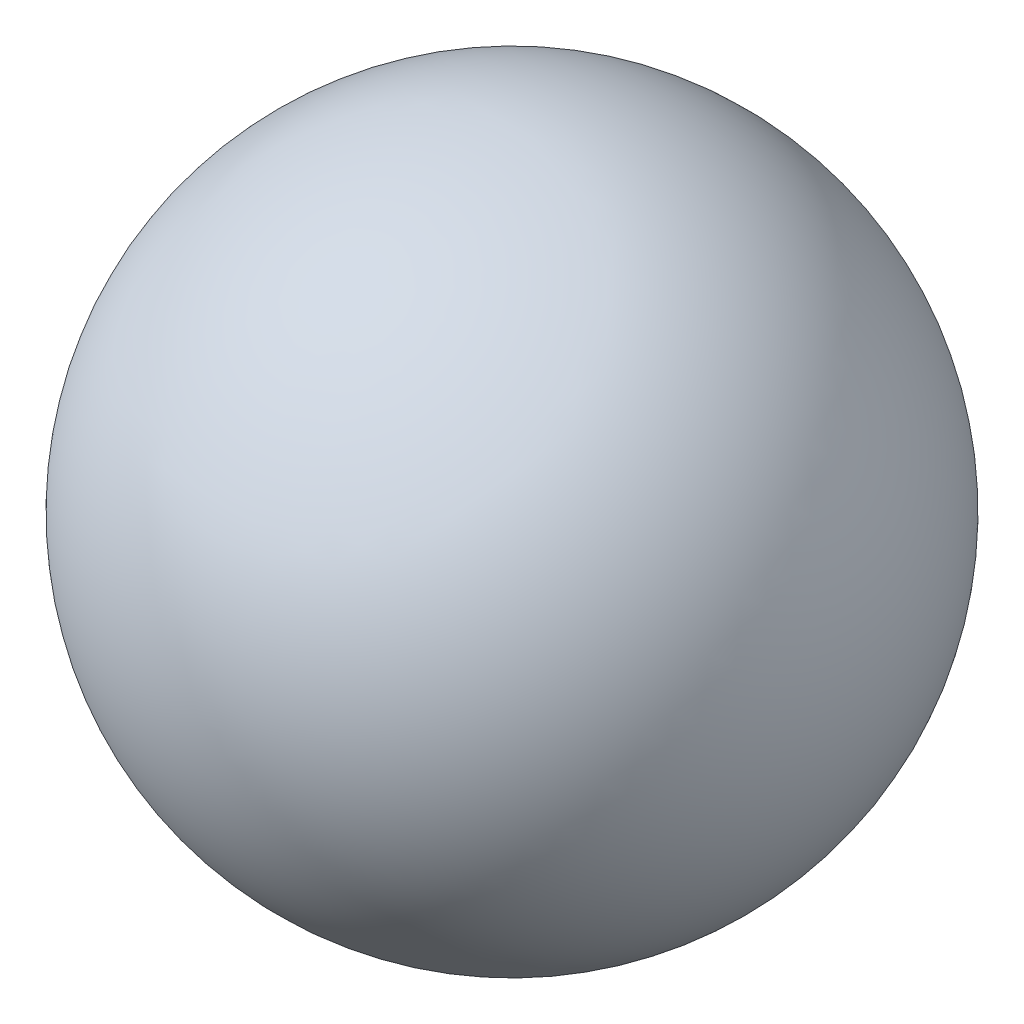
ISO-10303-21;
HEADER;
FILE_DESCRIPTION(('STEP AP214'),'2;1');
FILE_NAME('part.step','',(''),(''),'','','');
FILE_SCHEMA(('AUTOMOTIVE_DESIGN { 1 0 10303 214 1 1 1 1 }'));
ENDSEC;
DATA;
#1=APPLICATION_CONTEXT('core data for automotive mechanical design processes');
#2=APPLICATION_PROTOCOL_DEFINITION('international standard','automotive_design',2000,#1);
#3=PRODUCT_CONTEXT('',#1,'mechanical');
#4=PRODUCT('Part','Part','',(#3));
#5=PRODUCT_RELATED_PRODUCT_CATEGORY('part','',(#4));
#6=PRODUCT_DEFINITION_FORMATION('','',#4);
#7=PRODUCT_DEFINITION_CONTEXT('part definition',#1,'design');
#8=PRODUCT_DEFINITION('design','',#6,#7);
#9=PRODUCT_DEFINITION_SHAPE('','',#8);
#10=(LENGTH_UNIT() NAMED_UNIT(*) SI_UNIT(.MILLI.,.METRE.));
#11=(NAMED_UNIT(*) PLANE_ANGLE_UNIT() SI_UNIT($,.RADIAN.));
#12=(NAMED_UNIT(*) SI_UNIT($,.STERADIAN.) SOLID_ANGLE_UNIT());
#13=UNCERTAINTY_MEASURE_WITH_UNIT(LENGTH_MEASURE(1.E-05),#10,'distance_accuracy_value','');
#14=(GEOMETRIC_REPRESENTATION_CONTEXT(3) GLOBAL_UNCERTAINTY_ASSIGNED_CONTEXT((#13)) GLOBAL_UNIT_ASSIGNED_CONTEXT((#10,
#11,#12)) REPRESENTATION_CONTEXT('',''));
#15=CARTESIAN_POINT('',(0.,0.,0.));
#16=DIRECTION('',(0.,0.,1.));
#17=DIRECTION('',(1.,0.,0.));
#18=AXIS2_PLACEMENT_3D('',#15,#16,#17);
#19=CARTESIAN_POINT('',(64.16,51.1189285641106,-46.9132799051352));
#20=DIRECTION('',(0.,0.736764460517839,-0.676149487700661));
#21=DIRECTION('',(0.173648177666934,0.66587725768284,0.725571352861821));
#22=AXIS2_PLACEMENT_3D('',#19,#20,#21);
#23=SPHERICAL_SURFACE('',#22,7.15);
#24=CARTESIAN_POINT('',(64.16,56.386794456813,-51.7477487421949));
#25=VERTEX_POINT('',#24);
#26=VERTEX_LOOP('',#25);
#27=FACE_BOUND('',#26,.T.);
#28=CARTESIAN_POINT('',(64.16,45.851062671408,-42.0788110680753));
#29=VERTEX_POINT('',#28);
#30=VERTEX_LOOP('',#29);
#31=FACE_BOUND('',#30,.T.);
#32=ADVANCED_FACE('F15',(#27,#31),#23,.T.);
#33=CLOSED_SHELL('',(#32));
#34=MANIFOLD_SOLID_BREP('B1',#33);
#35=ADVANCED_BREP_SHAPE_REPRESENTATION('',(#18,#34),#14);
#36=SHAPE_DEFINITION_REPRESENTATION(#9,#35);
ENDSEC;
END-ISO-10303-21;
